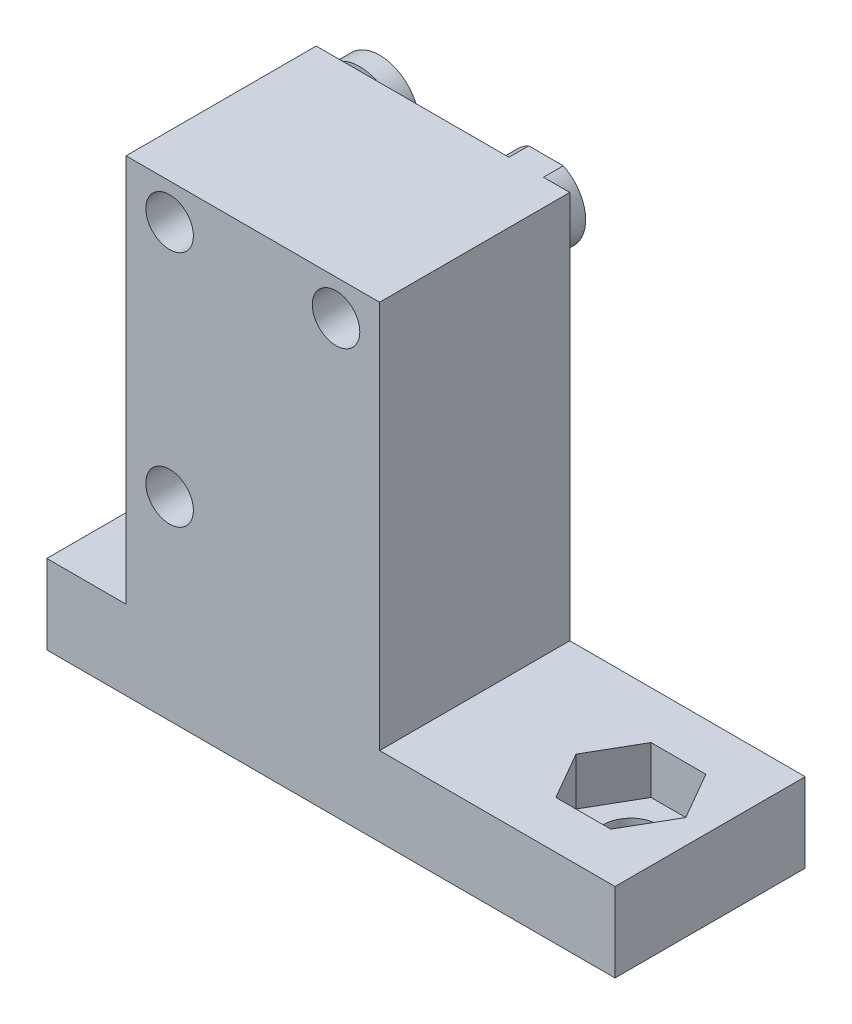
ISO-10303-21;
HEADER;
FILE_DESCRIPTION(('STEP AP214'),'2;1');
FILE_NAME('part.step','',(''),(''),'','','');
FILE_SCHEMA(('AUTOMOTIVE_DESIGN { 1 0 10303 214 1 1 1 1 }'));
ENDSEC;
DATA;
#1=APPLICATION_CONTEXT('core data for automotive mechanical design processes');
#2=APPLICATION_PROTOCOL_DEFINITION('international standard','automotive_design',2000,#1);
#3=PRODUCT_CONTEXT('',#1,'mechanical');
#4=PRODUCT('Part','Part','',(#3));
#5=PRODUCT_RELATED_PRODUCT_CATEGORY('part','',(#4));
#6=PRODUCT_DEFINITION_FORMATION('','',#4);
#7=PRODUCT_DEFINITION_CONTEXT('part definition',#1,'design');
#8=PRODUCT_DEFINITION('design','',#6,#7);
#9=PRODUCT_DEFINITION_SHAPE('','',#8);
#10=(LENGTH_UNIT() NAMED_UNIT(*) SI_UNIT(.MILLI.,.METRE.));
#11=(NAMED_UNIT(*) PLANE_ANGLE_UNIT() SI_UNIT($,.RADIAN.));
#12=(NAMED_UNIT(*) SI_UNIT($,.STERADIAN.) SOLID_ANGLE_UNIT());
#13=UNCERTAINTY_MEASURE_WITH_UNIT(LENGTH_MEASURE(1.E-05),#10,'distance_accuracy_value','');
#14=(GEOMETRIC_REPRESENTATION_CONTEXT(3) GLOBAL_UNCERTAINTY_ASSIGNED_CONTEXT((#13)) GLOBAL_UNIT_ASSIGNED_CONTEXT((#10,
#11,#12)) REPRESENTATION_CONTEXT('',''));
#15=CARTESIAN_POINT('',(0.,0.,0.));
#16=DIRECTION('',(0.,0.,1.));
#17=DIRECTION('',(1.,0.,0.));
#18=AXIS2_PLACEMENT_3D('',#15,#16,#17);
#19=CARTESIAN_POINT('',(0.,-14.249999999999,46.7217791579709));
#20=DIRECTION('',(-1.,0.,0.));
#21=DIRECTION('',(0.,-1.,0.));
#22=AXIS2_PLACEMENT_3D('',#19,#20,#21);
#23=PLANE('',#22);
#24=DIRECTION('',(0.,0.,1.));
#25=VECTOR('',#24,1.);
#26=CARTESIAN_POINT('',(0.,-4.7499999999993,46.721779157971));
#27=LINE('',#26,#25);
#28=CARTESIAN_POINT('',(0.,-4.74999999999909,1.25000000000051));
#29=VERTEX_POINT('',#28);
#30=CARTESIAN_POINT('',(0.,-4.74999999999912,6.14066724812784));
#31=VERTEX_POINT('',#30);
#32=EDGE_CURVE('E367',#29,#31,#27,.T.);
#33=ORIENTED_EDGE('',*,*,#32,.T.);
#34=DIRECTION('',(0.,-1.,0.));
#35=VECTOR('',#34,1.);
#36=CARTESIAN_POINT('',(0.,0.250000000000885,6.14066724812786));
#37=LINE('',#36,#35);
#38=CARTESIAN_POINT('',(0.,0.250000000000885,6.14066724812786));
#39=VERTEX_POINT('',#38);
#40=EDGE_CURVE('E310',#31,#39,#37,.F.);
#41=ORIENTED_EDGE('',*,*,#40,.T.);
#42=DIRECTION('',(0.,0.,-1.));
#43=VECTOR('',#42,1.);
#44=CARTESIAN_POINT('',(0.,0.250000000000701,46.721779157971));
#45=LINE('',#44,#43);
#46=CARTESIAN_POINT('',(0.,0.250000000000875,8.35933275187313));
#47=VERTEX_POINT('',#46);
#48=EDGE_CURVE('E12',#47,#39,#45,.T.);
#49=ORIENTED_EDGE('',*,*,#48,.F.);
#50=DIRECTION('',(0.,-1.,0.));
#51=VECTOR('',#50,1.);
#52=CARTESIAN_POINT('',(0.,0.250000000000875,8.35933275187313));
#53=LINE('',#52,#51);
#54=CARTESIAN_POINT('',(0.,-4.74999999999913,8.35933275187311));
#55=VERTEX_POINT('',#54);
#56=EDGE_CURVE('E307',#47,#55,#53,.T.);
#57=ORIENTED_EDGE('',*,*,#56,.T.);
#58=CARTESIAN_POINT('',(0.,-4.74999999999915,13.2500000000005));
#59=VERTEX_POINT('',#58);
#60=EDGE_CURVE('E366',#55,#59,#27,.T.);
#61=ORIENTED_EDGE('',*,*,#60,.T.);
#62=DIRECTION('',(0.,-1.,0.));
#63=VECTOR('',#62,1.);
#64=CARTESIAN_POINT('',(0.,-14.2499999999989,13.2500000000004));
#65=LINE('',#64,#63);
#66=CARTESIAN_POINT('',(0.,19.75,13.2500000000005));
#67=VERTEX_POINT('',#66);
#68=EDGE_CURVE('E417',#67,#59,#65,.T.);
#69=ORIENTED_EDGE('',*,*,#68,.F.);
#70=DIRECTION('',(0.,0.,-1.));
#71=VECTOR('',#70,1.);
#72=CARTESIAN_POINT('',(0.,19.75,46.7217791579711));
#73=LINE('',#72,#71);
#74=CARTESIAN_POINT('',(0.,19.75,1.25000000000058));
#75=VERTEX_POINT('',#74);
#76=EDGE_CURVE('E408',#67,#75,#73,.T.);
#77=ORIENTED_EDGE('',*,*,#76,.T.);
#78=DIRECTION('',(0.,1.,0.));
#79=VECTOR('',#78,1.);
#80=CARTESIAN_POINT('',(0.,-14.249999999999,1.25000000000043));
#81=LINE('',#80,#79);
#82=EDGE_CURVE('E387',#29,#75,#81,.T.);
#83=ORIENTED_EDGE('',*,*,#82,.F.);
#84=EDGE_LOOP('',(#33,#41,#49,#57,#61,#69,#77,#83));
#85=FACE_BOUND('',#84,.T.);
#86=ADVANCED_FACE('F132',(#85),#23,.T.);
#87=CARTESIAN_POINT('',(16.,-14.2499999999991,46.7217791579709));
#88=DIRECTION('',(-1.,0.,0.));
#89=DIRECTION('',(0.,0.,1.));
#90=AXIS2_PLACEMENT_3D('',#87,#88,#89);
#91=PLANE('',#90);
#92=DIRECTION('',(0.,0.,1.));
#93=VECTOR('',#92,1.);
#94=CARTESIAN_POINT('',(16.,-4.7499999999993,46.721779157971));
#95=LINE('',#94,#93);
#96=CARTESIAN_POINT('',(16.,-4.74999999999909,1.25000000000051));
#97=VERTEX_POINT('',#96);
#98=CARTESIAN_POINT('',(16.0000000000001,-4.74999999999915,13.2500000000005));
#99=VERTEX_POINT('',#98);
#100=EDGE_CURVE('E370',#97,#99,#95,.T.);
#101=ORIENTED_EDGE('',*,*,#100,.F.);
#102=DIRECTION('',(0.,1.,0.));
#103=VECTOR('',#102,1.);
#104=CARTESIAN_POINT('',(16.,-14.2499999999991,1.25000000000043));
#105=LINE('',#104,#103);
#106=CARTESIAN_POINT('',(16.,19.75,1.25000000000058));
#107=VERTEX_POINT('',#106);
#108=EDGE_CURVE('E401',#97,#107,#105,.T.);
#109=ORIENTED_EDGE('',*,*,#108,.T.);
#110=DIRECTION('',(0.,0.,-1.));
#111=VECTOR('',#110,1.);
#112=CARTESIAN_POINT('',(16.,19.75,46.7217791579711));
#113=LINE('',#112,#111);
#114=CARTESIAN_POINT('',(16.0000000000001,19.75,13.2500000000006));
#115=VERTEX_POINT('',#114);
#116=EDGE_CURVE('E412',#115,#107,#113,.T.);
#117=ORIENTED_EDGE('',*,*,#116,.F.);
#118=DIRECTION('',(0.,-1.,0.));
#119=VECTOR('',#118,1.);
#120=CARTESIAN_POINT('',(16.,-14.249999999999,13.2500000000004));
#121=LINE('',#120,#119);
#122=EDGE_CURVE('E404',#115,#99,#121,.T.);
#123=ORIENTED_EDGE('',*,*,#122,.T.);
#124=EDGE_LOOP('',(#101,#109,#117,#123));
#125=FACE_BOUND('',#124,.T.);
#126=ADVANCED_FACE('F456',(#125),#91,.F.);
#127=CARTESIAN_POINT('',(0.,0.,1.25000000000049));
#128=DIRECTION('',(0.,0.,-1.));
#129=DIRECTION('',(0.,1.,0.));
#130=AXIS2_PLACEMENT_3D('',#127,#128,#129);
#131=PLANE('',#130);
#132=DIRECTION('',(-1.,0.,0.));
#133=VECTOR('',#132,1.);
#134=CARTESIAN_POINT('',(30.8540379649774,-4.74999999999909,1.25000000000051));
#135=LINE('',#134,#133);
#136=CARTESIAN_POINT('',(-5.,-4.74999999999909,1.25000000000052));
#137=VERTEX_POINT('',#136);
#138=EDGE_CURVE('E338',#29,#137,#135,.T.);
#139=ORIENTED_EDGE('',*,*,#138,.F.);
#140=ORIENTED_EDGE('',*,*,#82,.T.);
#141=DIRECTION('',(-1.,0.,0.));
#142=VECTOR('',#141,1.);
#143=CARTESIAN_POINT('',(-361.645962035023,19.75,1.25000000000062));
#144=LINE('',#143,#142);
#145=CARTESIAN_POINT('',(1.66027526411483,19.75,1.25000000000058));
#146=VERTEX_POINT('',#145);
#147=EDGE_CURVE('E410',#146,#75,#144,.T.);
#148=ORIENTED_EDGE('',*,*,#147,.F.);
#149=CARTESIAN_POINT('',(2.74999999999999,17.5,1.25000000000057));
#150=DIRECTION('',(0.,0.,1.));
#151=DIRECTION('',(0.,-1.,0.));
#152=AXIS2_PLACEMENT_3D('',#149,#150,#151);
#153=CIRCLE('',#152,2.5);
#154=CARTESIAN_POINT('',(3.83972473588517,19.75,1.25000000000058));
#155=VERTEX_POINT('',#154);
#156=EDGE_CURVE('E372',#146,#155,#153,.T.);
#157=ORIENTED_EDGE('',*,*,#156,.T.);
#158=CARTESIAN_POINT('',(12.1602752641148,19.75,1.25000000000058));
#159=VERTEX_POINT('',#158);
#160=EDGE_CURVE('E409',#159,#155,#144,.T.);
#161=ORIENTED_EDGE('',*,*,#160,.F.);
#162=CARTESIAN_POINT('',(13.25,17.5,1.25000000000057));
#163=DIRECTION('',(0.,0.,1.));
#164=DIRECTION('',(0.,-1.,0.));
#165=AXIS2_PLACEMENT_3D('',#162,#163,#164);
#166=CIRCLE('',#165,2.5);
#167=CARTESIAN_POINT('',(14.3397247358852,19.75,1.25000000000058));
#168=VERTEX_POINT('',#167);
#169=EDGE_CURVE('E384',#159,#168,#166,.T.);
#170=ORIENTED_EDGE('',*,*,#169,.T.);
#171=EDGE_CURVE('E405',#107,#168,#144,.T.);
#172=ORIENTED_EDGE('',*,*,#171,.F.);
#173=ORIENTED_EDGE('',*,*,#108,.F.);
#174=CARTESIAN_POINT('',(30.8540379649774,-4.74999999999909,1.25000000000051));
#175=VERTEX_POINT('',#174);
#176=EDGE_CURVE('E335',#175,#97,#135,.T.);
#177=ORIENTED_EDGE('',*,*,#176,.F.);
#178=DIRECTION('',(0.,-1.,0.));
#179=VECTOR('',#178,1.);
#180=CARTESIAN_POINT('',(30.8540379649774,-4.74999999999909,1.25000000000051));
#181=LINE('',#180,#179);
#182=CARTESIAN_POINT('',(30.8540379649774,-9.74999999999909,1.25000000000049));
#183=VERTEX_POINT('',#182);
#184=EDGE_CURVE('E347',#175,#183,#181,.T.);
#185=ORIENTED_EDGE('',*,*,#184,.T.);
#186=DIRECTION('',(-1.,0.,0.));
#187=VECTOR('',#186,1.);
#188=CARTESIAN_POINT('',(30.8540379649774,-9.74999999999909,1.25000000000049));
#189=LINE('',#188,#187);
#190=CARTESIAN_POINT('',(-5.,-9.74999999999909,1.25000000000049));
#191=VERTEX_POINT('',#190);
#192=EDGE_CURVE('E334',#183,#191,#189,.T.);
#193=ORIENTED_EDGE('',*,*,#192,.T.);
#194=DIRECTION('',(0.,-1.,0.));
#195=VECTOR('',#194,1.);
#196=CARTESIAN_POINT('',(-5.,-4.74999999999909,1.25000000000052));
#197=LINE('',#196,#195);
#198=EDGE_CURVE('E363',#137,#191,#197,.T.);
#199=ORIENTED_EDGE('',*,*,#198,.F.);
#200=EDGE_LOOP('',(#139,#140,#148,#157,#161,#170,#172,#173,#177,#185,#193,#199));
#201=FACE_BOUND('',#200,.T.);
#202=CARTESIAN_POINT('',(2.74999999999999,2.5,1.2500000000005));
#203=DIRECTION('',(0.,0.,1.));
#204=DIRECTION('',(0.,-1.,0.));
#205=AXIS2_PLACEMENT_3D('',#202,#203,#204);
#206=CIRCLE('',#205,2.5);
#207=CARTESIAN_POINT('',(2.74999999999999,0.,1.25000000000049));
#208=VERTEX_POINT('',#207);
#209=EDGE_CURVE('E140',#208,#208,#206,.T.);
#210=ORIENTED_EDGE('',*,*,#209,.T.);
#211=EDGE_LOOP('',(#210));
#212=FACE_BOUND('',#211,.T.);
#213=ADVANCED_FACE('F441',(#201,#212),#131,.T.);
#214=CARTESIAN_POINT('',(2.74999999999999,2.5,8.32106781186605));
#215=DIRECTION('',(0.,0.,-1.));
#216=DIRECTION('',(-1.,0.,0.));
#217=AXIS2_PLACEMENT_3D('',#214,#215,#216);
#218=CYLINDRICAL_SURFACE('',#217,1.5);
#219=CARTESIAN_POINT('',(2.74999999999999,2.5,0.));
#220=DIRECTION('',(0.,0.,1.));
#221=DIRECTION('',(1.,0.,0.));
#222=AXIS2_PLACEMENT_3D('',#219,#220,#221);
#223=CIRCLE('',#222,1.5);
#224=CARTESIAN_POINT('',(4.24999999999999,2.5,0.));
#225=VERTEX_POINT('',#224);
#226=EDGE_CURVE('E436',#225,#225,#223,.T.);
#227=ORIENTED_EDGE('',*,*,#226,.F.);
#228=EDGE_LOOP('',(#227));
#229=FACE_BOUND('',#228,.T.);
#230=CARTESIAN_POINT('',(2.74999999999999,2.5,13.2500000000005));
#231=DIRECTION('',(0.,0.,-1.));
#232=DIRECTION('',(0.,1.,0.));
#233=AXIS2_PLACEMENT_3D('',#230,#231,#232);
#234=CIRCLE('',#233,1.5);
#235=CARTESIAN_POINT('',(2.74999999999999,4.,13.2500000000005));
#236=VERTEX_POINT('',#235);
#237=EDGE_CURVE('E427',#236,#236,#234,.T.);
#238=ORIENTED_EDGE('',*,*,#237,.F.);
#239=EDGE_LOOP('',(#238));
#240=FACE_BOUND('',#239,.T.);
#241=ADVANCED_FACE('F445',(#229,#240),#218,.F.);
#242=CARTESIAN_POINT('',(2.74999999999999,2.5,8.32106781186605));
#243=DIRECTION('',(0.,0.,-1.));
#244=DIRECTION('',(-1.,0.,0.));
#245=AXIS2_PLACEMENT_3D('',#242,#243,#244);
#246=CYLINDRICAL_SURFACE('',#245,2.5);
#247=CARTESIAN_POINT('',(2.74999999999999,2.5,0.));
#248=DIRECTION('',(0.,0.,1.));
#249=DIRECTION('',(1.,0.,0.));
#250=AXIS2_PLACEMENT_3D('',#247,#248,#249);
#251=CIRCLE('',#250,2.5);
#252=CARTESIAN_POINT('',(5.24999999999999,2.5,0.));
#253=VERTEX_POINT('',#252);
#254=EDGE_CURVE('E433',#253,#253,#251,.T.);
#255=ORIENTED_EDGE('',*,*,#254,.T.);
#256=EDGE_LOOP('',(#255));
#257=FACE_BOUND('',#256,.T.);
#258=ORIENTED_EDGE('',*,*,#209,.F.);
#259=EDGE_LOOP('',(#258));
#260=FACE_BOUND('',#259,.T.);
#261=ADVANCED_FACE('F134',(#257,#260),#246,.T.);
#262=CARTESIAN_POINT('',(0.,0.,0.));
#263=DIRECTION('',(0.,0.,1.));
#264=DIRECTION('',(1.,0.,0.));
#265=AXIS2_PLACEMENT_3D('',#262,#263,#264);
#266=PLANE('',#265);
#267=ORIENTED_EDGE('',*,*,#226,.T.);
#268=EDGE_LOOP('',(#267));
#269=FACE_BOUND('',#268,.T.);
#270=ORIENTED_EDGE('',*,*,#254,.F.);
#271=EDGE_LOOP('',(#270));
#272=FACE_BOUND('',#271,.T.);
#273=ADVANCED_FACE('F444',(#269,#272),#266,.F.);
#274=CARTESIAN_POINT('',(-361.645962035023,19.75,46.7217791579711));
#275=DIRECTION('',(0.,-1.,0.));
#276=DIRECTION('',(0.,0.,-1.));
#277=AXIS2_PLACEMENT_3D('',#274,#275,#276);
#278=PLANE('',#277);
#279=ORIENTED_EDGE('',*,*,#76,.F.);
#280=DIRECTION('',(1.,0.,0.));
#281=VECTOR('',#280,1.);
#282=CARTESIAN_POINT('',(-361.645962035023,19.75,13.2500000000006));
#283=LINE('',#282,#281);
#284=EDGE_CURVE('E403',#67,#115,#283,.T.);
#285=ORIENTED_EDGE('',*,*,#284,.T.);
#286=ORIENTED_EDGE('',*,*,#116,.T.);
#287=ORIENTED_EDGE('',*,*,#171,.T.);
#288=DIRECTION('',(0.,0.,-1.));
#289=VECTOR('',#288,1.);
#290=CARTESIAN_POINT('',(14.3397247358852,19.75,8.32106781186605));
#291=LINE('',#290,#289);
#292=CARTESIAN_POINT('',(14.3397247358852,19.75,0.));
#293=VERTEX_POINT('',#292);
#294=EDGE_CURVE('E385',#168,#293,#291,.T.);
#295=ORIENTED_EDGE('',*,*,#294,.T.);
#296=DIRECTION('',(1.,0.,0.));
#297=VECTOR('',#296,1.);
#298=CARTESIAN_POINT('',(0.,19.75,0.));
#299=LINE('',#298,#297);
#300=CARTESIAN_POINT('',(12.1602752641148,19.75,0.));
#301=VERTEX_POINT('',#300);
#302=EDGE_CURVE('E393',#301,#293,#299,.T.);
#303=ORIENTED_EDGE('',*,*,#302,.F.);
#304=DIRECTION('',(0.,0.,-1.));
#305=VECTOR('',#304,1.);
#306=CARTESIAN_POINT('',(12.1602752641148,19.75,8.32106781186605));
#307=LINE('',#306,#305);
#308=EDGE_CURVE('E388',#159,#301,#307,.T.);
#309=ORIENTED_EDGE('',*,*,#308,.F.);
#310=ORIENTED_EDGE('',*,*,#160,.T.);
#311=DIRECTION('',(-1.,0.,0.));
#312=VECTOR('',#311,1.);
#313=CARTESIAN_POINT('',(-361.645962035023,19.75,1.25000000000062));
#314=LINE('',#313,#312);
#315=EDGE_CURVE('E380',#155,#146,#314,.T.);
#316=ORIENTED_EDGE('',*,*,#315,.T.);
#317=ORIENTED_EDGE('',*,*,#147,.T.);
#318=EDGE_LOOP('',(#279,#285,#286,#287,#295,#303,#309,#310,#316,#317));
#319=FACE_BOUND('',#318,.T.);
#320=ADVANCED_FACE('F451',(#319),#278,.F.);
#321=CARTESIAN_POINT('',(2.74999999999999,17.5,46.7217791579711));
#322=DIRECTION('',(0.,0.,-1.));
#323=DIRECTION('',(-1.,0.,0.));
#324=AXIS2_PLACEMENT_3D('',#321,#322,#323);
#325=CYLINDRICAL_SURFACE('',#324,1.5);
#326=CARTESIAN_POINT('',(2.74999999999999,17.5,13.2500000000006));
#327=DIRECTION('',(0.,0.,-1.));
#328=DIRECTION('',(0.,1.,0.));
#329=AXIS2_PLACEMENT_3D('',#326,#327,#328);
#330=CIRCLE('',#329,1.5);
#331=CARTESIAN_POINT('',(2.74999999999999,19.,13.2500000000006));
#332=VERTEX_POINT('',#331);
#333=EDGE_CURVE('E424',#332,#332,#330,.T.);
#334=ORIENTED_EDGE('',*,*,#333,.F.);
#335=EDGE_LOOP('',(#334));
#336=FACE_BOUND('',#335,.T.);
#337=CARTESIAN_POINT('',(2.74999999999999,17.5,0.));
#338=DIRECTION('',(0.,0.,1.));
#339=DIRECTION('',(1.,0.,0.));
#340=AXIS2_PLACEMENT_3D('',#337,#338,#339);
#341=CIRCLE('',#340,1.5);
#342=CARTESIAN_POINT('',(4.24999999999999,17.5,0.));
#343=VERTEX_POINT('',#342);
#344=EDGE_CURVE('E376',#343,#343,#341,.T.);
#345=ORIENTED_EDGE('',*,*,#344,.F.);
#346=EDGE_LOOP('',(#345));
#347=FACE_BOUND('',#346,.T.);
#348=ADVANCED_FACE('F466',(#336,#347),#325,.F.);
#349=CARTESIAN_POINT('',(13.25,17.5,46.7217791579711));
#350=DIRECTION('',(0.,0.,-1.));
#351=DIRECTION('',(-1.,0.,0.));
#352=AXIS2_PLACEMENT_3D('',#349,#350,#351);
#353=CYLINDRICAL_SURFACE('',#352,1.5);
#354=CARTESIAN_POINT('',(13.25,17.5,13.2500000000006));
#355=DIRECTION('',(0.,0.,-1.));
#356=DIRECTION('',(0.,1.,0.));
#357=AXIS2_PLACEMENT_3D('',#354,#355,#356);
#358=CIRCLE('',#357,1.5);
#359=CARTESIAN_POINT('',(13.25,19.,13.2500000000006));
#360=VERTEX_POINT('',#359);
#361=EDGE_CURVE('E430',#360,#360,#358,.T.);
#362=ORIENTED_EDGE('',*,*,#361,.F.);
#363=EDGE_LOOP('',(#362));
#364=FACE_BOUND('',#363,.T.);
#365=CARTESIAN_POINT('',(13.25,17.5,0.));
#366=DIRECTION('',(0.,0.,1.));
#367=DIRECTION('',(1.,0.,0.));
#368=AXIS2_PLACEMENT_3D('',#365,#366,#367);
#369=CIRCLE('',#368,1.5);
#370=CARTESIAN_POINT('',(14.75,17.5,0.));
#371=VERTEX_POINT('',#370);
#372=EDGE_CURVE('E394',#371,#371,#369,.T.);
#373=ORIENTED_EDGE('',*,*,#372,.F.);
#374=EDGE_LOOP('',(#373));
#375=FACE_BOUND('',#374,.T.);
#376=ADVANCED_FACE('F471',(#364,#375),#353,.F.);
#377=CARTESIAN_POINT('',(-361.645962035023,-14.2499999999992,13.2500000000005));
#378=DIRECTION('',(0.,0.,-1.));
#379=DIRECTION('',(0.,-1.,0.));
#380=AXIS2_PLACEMENT_3D('',#377,#378,#379);
#381=PLANE('',#380);
#382=DIRECTION('',(-1.,0.,0.));
#383=VECTOR('',#382,1.);
#384=CARTESIAN_POINT('',(30.8540379649774,-4.74999999999915,13.2500000000005));
#385=LINE('',#384,#383);
#386=CARTESIAN_POINT('',(30.8540379649774,-4.74999999999915,13.2500000000005));
#387=VERTEX_POINT('',#386);
#388=EDGE_CURVE('E342',#387,#99,#385,.T.);
#389=ORIENTED_EDGE('',*,*,#388,.T.);
#390=ORIENTED_EDGE('',*,*,#122,.F.);
#391=ORIENTED_EDGE('',*,*,#284,.F.);
#392=ORIENTED_EDGE('',*,*,#68,.T.);
#393=CARTESIAN_POINT('',(-5.,-4.74999999999915,13.2500000000005));
#394=VERTEX_POINT('',#393);
#395=EDGE_CURVE('E341',#59,#394,#385,.T.);
#396=ORIENTED_EDGE('',*,*,#395,.T.);
#397=DIRECTION('',(0.,-1.,0.));
#398=VECTOR('',#397,1.);
#399=CARTESIAN_POINT('',(-5.,-4.74999999999915,13.2500000000005));
#400=LINE('',#399,#398);
#401=CARTESIAN_POINT('',(-5.,-9.74999999999915,13.2500000000005));
#402=VERTEX_POINT('',#401);
#403=EDGE_CURVE('E361',#394,#402,#400,.T.);
#404=ORIENTED_EDGE('',*,*,#403,.T.);
#405=DIRECTION('',(-1.,0.,0.));
#406=VECTOR('',#405,1.);
#407=CARTESIAN_POINT('',(30.8540379649774,-9.74999999999915,13.2500000000004));
#408=LINE('',#407,#406);
#409=CARTESIAN_POINT('',(30.8540379649774,-9.74999999999915,13.2500000000004));
#410=VERTEX_POINT('',#409);
#411=EDGE_CURVE('E352',#410,#402,#408,.T.);
#412=ORIENTED_EDGE('',*,*,#411,.F.);
#413=DIRECTION('',(0.,-1.,0.));
#414=VECTOR('',#413,1.);
#415=CARTESIAN_POINT('',(30.8540379649774,-4.74999999999915,13.2500000000005));
#416=LINE('',#415,#414);
#417=EDGE_CURVE('E359',#387,#410,#416,.T.);
#418=ORIENTED_EDGE('',*,*,#417,.F.);
#419=EDGE_LOOP('',(#389,#390,#391,#392,#396,#404,#412,#418));
#420=FACE_BOUND('',#419,.T.);
#421=ORIENTED_EDGE('',*,*,#361,.T.);
#422=EDGE_LOOP('',(#421));
#423=FACE_BOUND('',#422,.T.);
#424=ORIENTED_EDGE('',*,*,#237,.T.);
#425=EDGE_LOOP('',(#424));
#426=FACE_BOUND('',#425,.T.);
#427=ORIENTED_EDGE('',*,*,#333,.T.);
#428=EDGE_LOOP('',(#427));
#429=FACE_BOUND('',#428,.T.);
#430=ADVANCED_FACE('F474',(#420,#423,#426,#429),#381,.F.);
#431=CARTESIAN_POINT('',(13.25,17.5,8.32106781186605));
#432=DIRECTION('',(0.,0.,-1.));
#433=DIRECTION('',(-1.,0.,0.));
#434=AXIS2_PLACEMENT_3D('',#431,#432,#433);
#435=CYLINDRICAL_SURFACE('',#434,2.5);
#436=ORIENTED_EDGE('',*,*,#169,.F.);
#437=ORIENTED_EDGE('',*,*,#308,.T.);
#438=CARTESIAN_POINT('',(13.25,17.5,0.));
#439=DIRECTION('',(0.,0.,1.));
#440=DIRECTION('',(1.,0.,0.));
#441=AXIS2_PLACEMENT_3D('',#438,#439,#440);
#442=CIRCLE('',#441,2.5);
#443=EDGE_CURVE('E390',#301,#293,#442,.T.);
#444=ORIENTED_EDGE('',*,*,#443,.T.);
#445=ORIENTED_EDGE('',*,*,#294,.F.);
#446=EDGE_LOOP('',(#436,#437,#444,#445));
#447=FACE_BOUND('',#446,.T.);
#448=ADVANCED_FACE('F477',(#447),#435,.T.);
#449=CARTESIAN_POINT('',(0.,0.,0.));
#450=DIRECTION('',(0.,0.,1.));
#451=DIRECTION('',(1.,0.,0.));
#452=AXIS2_PLACEMENT_3D('',#449,#450,#451);
#453=PLANE('',#452);
#454=ORIENTED_EDGE('',*,*,#372,.T.);
#455=EDGE_LOOP('',(#454));
#456=FACE_BOUND('',#455,.T.);
#457=ORIENTED_EDGE('',*,*,#302,.T.);
#458=ORIENTED_EDGE('',*,*,#443,.F.);
#459=EDGE_LOOP('',(#457,#458));
#460=FACE_BOUND('',#459,.T.);
#461=ADVANCED_FACE('F482',(#456,#460),#453,.F.);
#462=CARTESIAN_POINT('',(-361.645962035023,-14.2499999999991,1.25000000000047));
#463=DIRECTION('',(0.,0.,1.));
#464=DIRECTION('',(0.,1.,0.));
#465=AXIS2_PLACEMENT_3D('',#462,#463,#464);
#466=PLANE('',#465);
#467=ORIENTED_EDGE('',*,*,#315,.F.);
#468=EDGE_CURVE('E377',#155,#146,#153,.T.);
#469=ORIENTED_EDGE('',*,*,#468,.T.);
#470=EDGE_LOOP('',(#467,#469));
#471=FACE_BOUND('',#470,.T.);
#472=ADVANCED_FACE('F510',(#471),#466,.T.);
#473=CARTESIAN_POINT('',(2.74999999999999,17.5,8.32106781186605));
#474=DIRECTION('',(0.,0.,-1.));
#475=DIRECTION('',(-1.,0.,0.));
#476=AXIS2_PLACEMENT_3D('',#473,#474,#475);
#477=CYLINDRICAL_SURFACE('',#476,2.5);
#478=CARTESIAN_POINT('',(2.74999999999999,17.5,0.));
#479=DIRECTION('',(0.,0.,1.));
#480=DIRECTION('',(1.,0.,0.));
#481=AXIS2_PLACEMENT_3D('',#478,#479,#480);
#482=CIRCLE('',#481,2.5);
#483=CARTESIAN_POINT('',(5.24999999999999,17.5,0.));
#484=VERTEX_POINT('',#483);
#485=EDGE_CURVE('E373',#484,#484,#482,.T.);
#486=ORIENTED_EDGE('',*,*,#485,.T.);
#487=EDGE_LOOP('',(#486));
#488=FACE_BOUND('',#487,.T.);
#489=ORIENTED_EDGE('',*,*,#468,.F.);
#490=ORIENTED_EDGE('',*,*,#156,.F.);
#491=EDGE_LOOP('',(#489,#490));
#492=FACE_BOUND('',#491,.T.);
#493=ADVANCED_FACE('F500',(#488,#492),#477,.T.);
#494=CARTESIAN_POINT('',(2.74999999999999,17.5,0.));
#495=DIRECTION('',(0.,0.,1.));
#496=DIRECTION('',(1.,0.,0.));
#497=AXIS2_PLACEMENT_3D('',#494,#495,#496);
#498=PLANE('',#497);
#499=ORIENTED_EDGE('',*,*,#485,.F.);
#500=EDGE_LOOP('',(#499));
#501=FACE_BOUND('',#500,.T.);
#502=ORIENTED_EDGE('',*,*,#344,.T.);
#503=EDGE_LOOP('',(#502));
#504=FACE_BOUND('',#503,.T.);
#505=ADVANCED_FACE('F497',(#501,#504),#498,.F.);
#506=CARTESIAN_POINT('',(0.,-4.74999999999909,0.));
#507=DIRECTION('',(0.,-1.,0.));
#508=DIRECTION('',(0.,0.,-1.));
#509=AXIS2_PLACEMENT_3D('',#506,#507,#508);
#510=PLANE('',#509);
#511=DIRECTION('',(0.499999999999999,0.,-0.866025403784439));
#512=VECTOR('',#511,1.);
#513=CARTESIAN_POINT('',(27.5860887725462,-4.74999999999913,10.2500000000005));
#514=LINE('',#513,#512);
#515=CARTESIAN_POINT('',(27.5860887725462,-4.74999999999913,10.2500000000005));
#516=VERTEX_POINT('',#515);
#517=CARTESIAN_POINT('',(29.3181395801151,-4.74999999999912,7.25000000000047));
#518=VERTEX_POINT('',#517);
#519=EDGE_CURVE('E313',#516,#518,#514,.T.);
#520=ORIENTED_EDGE('',*,*,#519,.F.);
#521=DIRECTION('',(1.,0.,0.));
#522=VECTOR('',#521,1.);
#523=CARTESIAN_POINT('',(24.1219871574085,-4.74999999999913,10.2500000000005));
#524=LINE('',#523,#522);
#525=CARTESIAN_POINT('',(24.1219871574085,-4.74999999999913,10.2500000000005));
#526=VERTEX_POINT('',#525);
#527=EDGE_CURVE('E271',#526,#516,#524,.T.);
#528=ORIENTED_EDGE('',*,*,#527,.F.);
#529=DIRECTION('',(0.499999999999999,0.,0.866025403784439));
#530=VECTOR('',#529,1.);
#531=CARTESIAN_POINT('',(22.3899363498396,-4.74999999999912,7.25000000000047));
#532=LINE('',#531,#530);
#533=CARTESIAN_POINT('',(22.3899363498396,-4.74999999999912,7.25000000000047));
#534=VERTEX_POINT('',#533);
#535=EDGE_CURVE('E321',#534,#526,#532,.T.);
#536=ORIENTED_EDGE('',*,*,#535,.F.);
#537=DIRECTION('',(-0.500000000000002,0.,0.866025403784438));
#538=VECTOR('',#537,1.);
#539=CARTESIAN_POINT('',(24.1219871574085,-4.7499999999991,4.25000000000048));
#540=LINE('',#539,#538);
#541=CARTESIAN_POINT('',(24.1219871574085,-4.7499999999991,4.25000000000048));
#542=VERTEX_POINT('',#541);
#543=EDGE_CURVE('E319',#542,#534,#540,.T.);
#544=ORIENTED_EDGE('',*,*,#543,.F.);
#545=DIRECTION('',(-1.,0.,0.));
#546=VECTOR('',#545,1.);
#547=CARTESIAN_POINT('',(27.5860887725463,-4.7499999999991,4.25000000000048));
#548=LINE('',#547,#546);
#549=CARTESIAN_POINT('',(27.5860887725463,-4.7499999999991,4.25000000000048));
#550=VERTEX_POINT('',#549);
#551=EDGE_CURVE('E317',#550,#542,#548,.T.);
#552=ORIENTED_EDGE('',*,*,#551,.F.);
#553=DIRECTION('',(-0.499999999999999,0.,-0.866025403784439));
#554=VECTOR('',#553,1.);
#555=CARTESIAN_POINT('',(29.3181395801151,-4.74999999999912,7.25000000000047));
#556=LINE('',#555,#554);
#557=EDGE_CURVE('E315',#518,#550,#556,.T.);
#558=ORIENTED_EDGE('',*,*,#557,.F.);
#559=EDGE_LOOP('',(#520,#528,#536,#544,#552,#558));
#560=FACE_BOUND('',#559,.T.);
#561=ORIENTED_EDGE('',*,*,#176,.T.);
#562=ORIENTED_EDGE('',*,*,#100,.T.);
#563=ORIENTED_EDGE('',*,*,#388,.F.);
#564=DIRECTION('',(0.,0.,-1.));
#565=VECTOR('',#564,1.);
#566=CARTESIAN_POINT('',(30.8540379649774,-4.74999999999915,13.2500000000005));
#567=LINE('',#566,#565);
#568=EDGE_CURVE('E345',#387,#175,#567,.T.);
#569=ORIENTED_EDGE('',*,*,#568,.T.);
#570=EDGE_LOOP('',(#561,#562,#563,#569));
#571=FACE_BOUND('',#570,.T.);
#572=ADVANCED_FACE('F499',(#560,#571),#510,.F.);
#573=CARTESIAN_POINT('',(0.854037964977364,-4.74999999999912,7.25000000000047));
#574=DIRECTION('',(0.,-1.,0.));
#575=DIRECTION('',(0.,0.,-1.));
#576=AXIS2_PLACEMENT_3D('',#573,#574,#575);
#577=CIRCLE('',#576,1.4);
#578=EDGE_CURVE('E303',#31,#55,#577,.F.);
#579=ORIENTED_EDGE('',*,*,#578,.F.);
#580=ORIENTED_EDGE('',*,*,#32,.F.);
#581=ORIENTED_EDGE('',*,*,#138,.T.);
#582=DIRECTION('',(0.,0.,-1.));
#583=VECTOR('',#582,1.);
#584=CARTESIAN_POINT('',(-5.,-4.74999999999915,13.2500000000005));
#585=LINE('',#584,#583);
#586=EDGE_CURVE('E337',#394,#137,#585,.T.);
#587=ORIENTED_EDGE('',*,*,#586,.F.);
#588=ORIENTED_EDGE('',*,*,#395,.F.);
#589=ORIENTED_EDGE('',*,*,#60,.F.);
#590=EDGE_LOOP('',(#579,#580,#581,#587,#588,#589));
#591=FACE_BOUND('',#590,.T.);
#592=ADVANCED_FACE('F507',(#591),#510,.F.);
#593=CARTESIAN_POINT('',(0.,-9.74999999999909,0.));
#594=DIRECTION('',(0.,-1.,0.));
#595=DIRECTION('',(0.,0.,-1.));
#596=AXIS2_PLACEMENT_3D('',#593,#594,#595);
#597=PLANE('',#596);
#598=CARTESIAN_POINT('',(0.854037964977364,-9.74999999999912,7.25000000000045));
#599=DIRECTION('',(0.,1.,0.));
#600=DIRECTION('',(0.,0.,1.));
#601=AXIS2_PLACEMENT_3D('',#598,#599,#600);
#602=CIRCLE('',#601,1.4);
#603=CARTESIAN_POINT('',(0.854037964977364,-9.74999999999913,8.65000000000045));
#604=VERTEX_POINT('',#603);
#605=EDGE_CURVE('E297',#604,#604,#602,.T.);
#606=ORIENTED_EDGE('',*,*,#605,.T.);
#607=EDGE_LOOP('',(#606));
#608=FACE_BOUND('',#607,.T.);
#609=ORIENTED_EDGE('',*,*,#192,.F.);
#610=DIRECTION('',(0.,0.,-1.));
#611=VECTOR('',#610,1.);
#612=CARTESIAN_POINT('',(30.8540379649774,-9.74999999999915,13.2500000000004));
#613=LINE('',#612,#611);
#614=EDGE_CURVE('E355',#410,#183,#613,.T.);
#615=ORIENTED_EDGE('',*,*,#614,.F.);
#616=ORIENTED_EDGE('',*,*,#411,.T.);
#617=DIRECTION('',(0.,0.,-1.));
#618=VECTOR('',#617,1.);
#619=CARTESIAN_POINT('',(-5.,-9.74999999999915,13.2500000000005));
#620=LINE('',#619,#618);
#621=EDGE_CURVE('E350',#402,#191,#620,.T.);
#622=ORIENTED_EDGE('',*,*,#621,.T.);
#623=EDGE_LOOP('',(#609,#615,#616,#622));
#624=FACE_BOUND('',#623,.T.);
#625=CARTESIAN_POINT('',(25.8540379649774,-9.74999999999912,7.25000000000045));
#626=DIRECTION('',(0.,1.,0.));
#627=DIRECTION('',(0.,0.,1.));
#628=AXIS2_PLACEMENT_3D('',#625,#626,#627);
#629=CIRCLE('',#628,1.75);
#630=CARTESIAN_POINT('',(25.8540379649774,-9.74999999999913,9.00000000000045));
#631=VERTEX_POINT('',#630);
#632=EDGE_CURVE('E289',#631,#631,#629,.F.);
#633=ORIENTED_EDGE('',*,*,#632,.F.);
#634=EDGE_LOOP('',(#633));
#635=FACE_BOUND('',#634,.T.);
#636=ADVANCED_FACE('F556',(#608,#624,#635),#597,.T.);
#637=CARTESIAN_POINT('',(-5.,-4.74999999999915,13.2500000000005));
#638=DIRECTION('',(-1.,0.,0.));
#639=DIRECTION('',(0.,0.,1.));
#640=AXIS2_PLACEMENT_3D('',#637,#638,#639);
#641=PLANE('',#640);
#642=ORIENTED_EDGE('',*,*,#198,.T.);
#643=ORIENTED_EDGE('',*,*,#621,.F.);
#644=ORIENTED_EDGE('',*,*,#403,.F.);
#645=ORIENTED_EDGE('',*,*,#586,.T.);
#646=EDGE_LOOP('',(#642,#643,#644,#645));
#647=FACE_BOUND('',#646,.T.);
#648=ADVANCED_FACE('F562',(#647),#641,.T.);
#649=CARTESIAN_POINT('',(30.8540379649774,-4.74999999999915,13.2500000000005));
#650=DIRECTION('',(-1.,0.,0.));
#651=DIRECTION('',(0.,-1.,0.));
#652=AXIS2_PLACEMENT_3D('',#649,#650,#651);
#653=PLANE('',#652);
#654=ORIENTED_EDGE('',*,*,#614,.T.);
#655=ORIENTED_EDGE('',*,*,#184,.F.);
#656=ORIENTED_EDGE('',*,*,#568,.F.);
#657=ORIENTED_EDGE('',*,*,#417,.T.);
#658=EDGE_LOOP('',(#654,#655,#656,#657));
#659=FACE_BOUND('',#658,.T.);
#660=ADVANCED_FACE('F552',(#659),#653,.F.);
#661=CARTESIAN_POINT('',(27.5860887725462,-4.74999999999913,10.2500000000005));
#662=DIRECTION('',(-0.866025403784439,0.,-0.499999999999999));
#663=DIRECTION('',(-0.499999999999999,0.,0.866025403784439));
#664=AXIS2_PLACEMENT_3D('',#661,#662,#663);
#665=PLANE('',#664);
#666=DIRECTION('',(0.499999999999999,0.,-0.866025403784439));
#667=VECTOR('',#666,1.);
#668=CARTESIAN_POINT('',(25.1279467738052,-7.74999999999915,14.5076268340389));
#669=LINE('',#668,#667);
#670=CARTESIAN_POINT('',(27.5860887725462,-7.74999999999913,10.2500000000005));
#671=VERTEX_POINT('',#670);
#672=CARTESIAN_POINT('',(29.3181395801151,-7.74999999999911,7.25000000000045));
#673=VERTEX_POINT('',#672);
#674=EDGE_CURVE('E277',#671,#673,#669,.T.);
#675=ORIENTED_EDGE('',*,*,#674,.F.);
#676=DIRECTION('',(0.,-1.,0.));
#677=VECTOR('',#676,1.);
#678=CARTESIAN_POINT('',(27.5860887725462,-4.74999999999913,10.2500000000005));
#679=LINE('',#678,#677);
#680=EDGE_CURVE('E264',#516,#671,#679,.T.);
#681=ORIENTED_EDGE('',*,*,#680,.F.);
#682=ORIENTED_EDGE('',*,*,#519,.T.);
#683=DIRECTION('',(0.,-1.,0.));
#684=VECTOR('',#683,1.);
#685=CARTESIAN_POINT('',(29.3181395801151,-4.74999999999912,7.25000000000047));
#686=LINE('',#685,#684);
#687=EDGE_CURVE('E279',#518,#673,#686,.T.);
#688=ORIENTED_EDGE('',*,*,#687,.T.);
#689=EDGE_LOOP('',(#675,#681,#682,#688));
#690=FACE_BOUND('',#689,.T.);
#691=ADVANCED_FACE('F278',(#690),#665,.T.);
#692=CARTESIAN_POINT('',(29.3181395801151,-4.74999999999912,7.25000000000047));
#693=DIRECTION('',(-0.866025403784439,0.,0.499999999999999));
#694=DIRECTION('',(0.499999999999999,0.,0.866025403784439));
#695=AXIS2_PLACEMENT_3D('',#692,#693,#694);
#696=PLANE('',#695);
#697=DIRECTION('',(-0.499999999999999,0.,-0.866025403784439));
#698=VECTOR('',#697,1.);
#699=CARTESIAN_POINT('',(18.8492625963676,-7.74999999999904,-10.8826268340388));
#700=LINE('',#699,#698);
#701=CARTESIAN_POINT('',(27.5860887725463,-7.7499999999991,4.25000000000046));
#702=VERTEX_POINT('',#701);
#703=EDGE_CURVE('E147',#673,#702,#700,.T.);
#704=ORIENTED_EDGE('',*,*,#703,.F.);
#705=ORIENTED_EDGE('',*,*,#687,.F.);
#706=ORIENTED_EDGE('',*,*,#557,.T.);
#707=DIRECTION('',(0.,-1.,0.));
#708=VECTOR('',#707,1.);
#709=CARTESIAN_POINT('',(27.5860887725463,-4.7499999999991,4.25000000000048));
#710=LINE('',#709,#708);
#711=EDGE_CURVE('E331',#550,#702,#710,.T.);
#712=ORIENTED_EDGE('',*,*,#711,.T.);
#713=EDGE_LOOP('',(#704,#705,#706,#712));
#714=FACE_BOUND('',#713,.T.);
#715=ADVANCED_FACE('F597',(#714),#696,.T.);
#716=CARTESIAN_POINT('',(27.5860887725463,-4.7499999999991,4.25000000000048));
#717=DIRECTION('',(0.,0.,1.));
#718=DIRECTION('',(0.,-1.,0.));
#719=AXIS2_PLACEMENT_3D('',#716,#717,#718);
#720=PLANE('',#719);
#721=DIRECTION('',(-1.,0.,0.));
#722=VECTOR('',#721,1.);
#723=CARTESIAN_POINT('',(0.,-7.74999999999911,4.25000000000048));
#724=LINE('',#723,#722);
#725=CARTESIAN_POINT('',(24.1219871574085,-7.74999999999911,4.25000000000046));
#726=VERTEX_POINT('',#725);
#727=EDGE_CURVE('E155',#702,#726,#724,.T.);
#728=ORIENTED_EDGE('',*,*,#727,.F.);
#729=ORIENTED_EDGE('',*,*,#711,.F.);
#730=ORIENTED_EDGE('',*,*,#551,.T.);
#731=DIRECTION('',(0.,-1.,0.));
#732=VECTOR('',#731,1.);
#733=CARTESIAN_POINT('',(24.1219871574085,-4.7499999999991,4.25000000000048));
#734=LINE('',#733,#732);
#735=EDGE_CURVE('E329',#542,#726,#734,.T.);
#736=ORIENTED_EDGE('',*,*,#735,.T.);
#737=EDGE_LOOP('',(#728,#729,#730,#736));
#738=FACE_BOUND('',#737,.T.);
#739=ADVANCED_FACE('F593',(#738),#720,.T.);
#740=CARTESIAN_POINT('',(24.1219871574085,-4.7499999999991,4.25000000000048));
#741=DIRECTION('',(0.866025403784438,0.,0.500000000000002));
#742=DIRECTION('',(0.500000000000002,0.,-0.866025403784438));
#743=AXIS2_PLACEMENT_3D('',#740,#741,#742);
#744=PLANE('',#743);
#745=DIRECTION('',(-0.500000000000002,0.,0.866025403784438));
#746=VECTOR('',#745,1.);
#747=CARTESIAN_POINT('',(19.9317943510985,-7.74999999999914,11.507626834039));
#748=LINE('',#747,#746);
#749=CARTESIAN_POINT('',(22.3899363498396,-7.74999999999913,7.25000000000045));
#750=VERTEX_POINT('',#749);
#751=EDGE_CURVE('E294',#726,#750,#748,.T.);
#752=ORIENTED_EDGE('',*,*,#751,.F.);
#753=ORIENTED_EDGE('',*,*,#735,.F.);
#754=ORIENTED_EDGE('',*,*,#543,.T.);
#755=DIRECTION('',(0.,-1.,0.));
#756=VECTOR('',#755,1.);
#757=CARTESIAN_POINT('',(22.3899363498396,-4.74999999999912,7.25000000000047));
#758=LINE('',#757,#756);
#759=EDGE_CURVE('E326',#534,#750,#758,.T.);
#760=ORIENTED_EDGE('',*,*,#759,.T.);
#761=EDGE_LOOP('',(#752,#753,#754,#760));
#762=FACE_BOUND('',#761,.T.);
#763=ADVANCED_FACE('F589',(#762),#744,.T.);
#764=CARTESIAN_POINT('',(22.3899363498396,-4.74999999999912,7.25000000000047));
#765=DIRECTION('',(0.866025403784439,0.,-0.499999999999999));
#766=DIRECTION('',(-0.499999999999999,0.,-0.866025403784439));
#767=AXIS2_PLACEMENT_3D('',#764,#765,#766);
#768=PLANE('',#767);
#769=DIRECTION('',(0.499999999999999,0.,0.866025403784439));
#770=VECTOR('',#769,1.);
#771=CARTESIAN_POINT('',(13.6531101736609,-7.74999999999905,-7.88262683403877));
#772=LINE('',#771,#770);
#773=CARTESIAN_POINT('',(24.1219871574085,-7.74999999999913,10.2500000000005));
#774=VERTEX_POINT('',#773);
#775=EDGE_CURVE('E285',#750,#774,#772,.T.);
#776=ORIENTED_EDGE('',*,*,#775,.F.);
#777=ORIENTED_EDGE('',*,*,#759,.F.);
#778=ORIENTED_EDGE('',*,*,#535,.T.);
#779=DIRECTION('',(0.,-1.,0.));
#780=VECTOR('',#779,1.);
#781=CARTESIAN_POINT('',(24.1219871574085,-4.74999999999913,10.2500000000005));
#782=LINE('',#781,#780);
#783=EDGE_CURVE('E274',#526,#774,#782,.T.);
#784=ORIENTED_EDGE('',*,*,#783,.T.);
#785=EDGE_LOOP('',(#776,#777,#778,#784));
#786=FACE_BOUND('',#785,.T.);
#787=ADVANCED_FACE('F586',(#786),#768,.T.);
#788=CARTESIAN_POINT('',(24.1219871574085,-4.74999999999913,10.2500000000005));
#789=DIRECTION('',(0.,0.,-1.));
#790=DIRECTION('',(0.,1.,0.));
#791=AXIS2_PLACEMENT_3D('',#788,#789,#790);
#792=PLANE('',#791);
#793=DIRECTION('',(1.,0.,0.));
#794=VECTOR('',#793,1.);
#795=CARTESIAN_POINT('',(0.,-7.74999999999913,10.2500000000005));
#796=LINE('',#795,#794);
#797=EDGE_CURVE('E268',#774,#671,#796,.T.);
#798=ORIENTED_EDGE('',*,*,#797,.F.);
#799=ORIENTED_EDGE('',*,*,#783,.F.);
#800=ORIENTED_EDGE('',*,*,#527,.T.);
#801=ORIENTED_EDGE('',*,*,#680,.T.);
#802=EDGE_LOOP('',(#798,#799,#800,#801));
#803=FACE_BOUND('',#802,.T.);
#804=ADVANCED_FACE('F266',(#803),#792,.T.);
#805=CARTESIAN_POINT('',(0.854037964977364,0.25000000000088,7.2500000000005));
#806=DIRECTION('',(0.,-1.,0.));
#807=DIRECTION('',(0.,0.,-1.));
#808=AXIS2_PLACEMENT_3D('',#805,#806,#807);
#809=CYLINDRICAL_SURFACE('',#808,1.4);
#810=ORIENTED_EDGE('',*,*,#578,.T.);
#811=ORIENTED_EDGE('',*,*,#56,.F.);
#812=CARTESIAN_POINT('',(0.854037964977364,0.25000000000088,7.2500000000005));
#813=DIRECTION('',(0.,1.,0.));
#814=DIRECTION('',(0.,0.,1.));
#815=AXIS2_PLACEMENT_3D('',#812,#813,#814);
#816=CIRCLE('',#815,1.4);
#817=EDGE_CURVE('E300',#47,#39,#816,.T.);
#818=ORIENTED_EDGE('',*,*,#817,.T.);
#819=ORIENTED_EDGE('',*,*,#40,.F.);
#820=EDGE_LOOP('',(#810,#811,#818,#819));
#821=FACE_BOUND('',#820,.T.);
#822=ORIENTED_EDGE('',*,*,#605,.F.);
#823=EDGE_LOOP('',(#822));
#824=FACE_BOUND('',#823,.T.);
#825=ADVANCED_FACE('F568',(#821,#824),#809,.F.);
#826=CARTESIAN_POINT('',(0.,0.250000000000913,0.));
#827=DIRECTION('',(0.,1.,0.));
#828=DIRECTION('',(0.,0.,1.));
#829=AXIS2_PLACEMENT_3D('',#826,#827,#828);
#830=PLANE('',#829);
#831=ORIENTED_EDGE('',*,*,#48,.T.);
#832=ORIENTED_EDGE('',*,*,#817,.F.);
#833=EDGE_LOOP('',(#831,#832));
#834=FACE_BOUND('',#833,.T.);
#835=ADVANCED_FACE('F571',(#834),#830,.F.);
#836=CARTESIAN_POINT('',(25.8540379649774,-7.74999999999912,7.25000000000046));
#837=DIRECTION('',(0.,-1.,0.));
#838=DIRECTION('',(0.,0.,-1.));
#839=AXIS2_PLACEMENT_3D('',#836,#837,#838);
#840=CYLINDRICAL_SURFACE('',#839,1.75);
#841=CARTESIAN_POINT('',(25.8540379649774,-7.74999999999912,7.25000000000046));
#842=DIRECTION('',(0.,1.,0.));
#843=DIRECTION('',(0.,0.,1.));
#844=AXIS2_PLACEMENT_3D('',#841,#842,#843);
#845=CIRCLE('',#844,1.75);
#846=CARTESIAN_POINT('',(25.8540379649774,-7.74999999999913,9.00000000000045));
#847=VERTEX_POINT('',#846);
#848=EDGE_CURVE('E286',#847,#847,#845,.F.);
#849=ORIENTED_EDGE('',*,*,#848,.F.);
#850=EDGE_LOOP('',(#849));
#851=FACE_BOUND('',#850,.T.);
#852=ORIENTED_EDGE('',*,*,#632,.T.);
#853=EDGE_LOOP('',(#852));
#854=FACE_BOUND('',#853,.T.);
#855=ADVANCED_FACE('F573',(#851,#854),#840,.F.);
#856=CARTESIAN_POINT('',(0.,-7.74999999999909,0.));
#857=DIRECTION('',(0.,1.,0.));
#858=DIRECTION('',(0.,0.,1.));
#859=AXIS2_PLACEMENT_3D('',#856,#857,#858);
#860=PLANE('',#859);
#861=ORIENTED_EDGE('',*,*,#848,.T.);
#862=EDGE_LOOP('',(#861));
#863=FACE_BOUND('',#862,.T.);
#864=ORIENTED_EDGE('',*,*,#797,.T.);
#865=ORIENTED_EDGE('',*,*,#674,.T.);
#866=ORIENTED_EDGE('',*,*,#703,.T.);
#867=ORIENTED_EDGE('',*,*,#727,.T.);
#868=ORIENTED_EDGE('',*,*,#751,.T.);
#869=ORIENTED_EDGE('',*,*,#775,.T.);
#870=EDGE_LOOP('',(#864,#865,#866,#867,#868,#869));
#871=FACE_BOUND('',#870,.T.);
#872=ADVANCED_FACE('F283',(#863,#871),#860,.T.);
#873=CLOSED_SHELL('',(#86,#126,#213,#241,#261,#273,#320,#348,#376,#430,#448,#461,#472,#493,#505,
#572,#592,#636,#648,#660,#691,#715,#739,#763,#787,#804,#825,#835,#855,#872));
#874=MANIFOLD_SOLID_BREP('B2',#873);
#875=ADVANCED_BREP_SHAPE_REPRESENTATION('',(#18,#874),#14);
#876=SHAPE_DEFINITION_REPRESENTATION(#9,#875);
ENDSEC;
END-ISO-10303-21;
